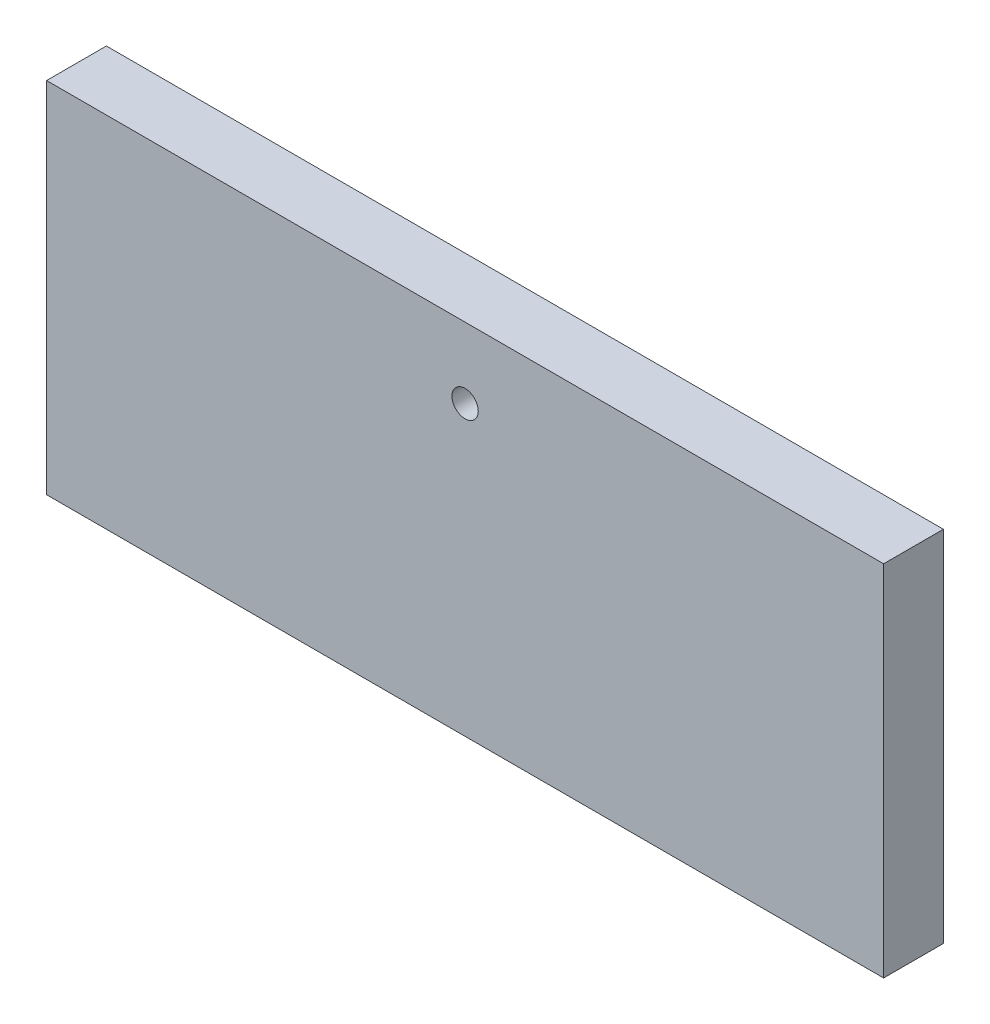
ISO-10303-21;
HEADER;
FILE_DESCRIPTION(('STEP AP214'),'2;1');
FILE_NAME('part.step','',(''),(''),'','','');
FILE_SCHEMA(('AUTOMOTIVE_DESIGN { 1 0 10303 214 1 1 1 1 }'));
ENDSEC;
DATA;
#1=APPLICATION_CONTEXT('core data for automotive mechanical design processes');
#2=APPLICATION_PROTOCOL_DEFINITION('international standard','automotive_design',2000,#1);
#3=PRODUCT_CONTEXT('',#1,'mechanical');
#4=PRODUCT('Part','Part','',(#3));
#5=PRODUCT_RELATED_PRODUCT_CATEGORY('part','',(#4));
#6=PRODUCT_DEFINITION_FORMATION('','',#4);
#7=PRODUCT_DEFINITION_CONTEXT('part definition',#1,'design');
#8=PRODUCT_DEFINITION('design','',#6,#7);
#9=PRODUCT_DEFINITION_SHAPE('','',#8);
#10=(LENGTH_UNIT() NAMED_UNIT(*) SI_UNIT(.MILLI.,.METRE.));
#11=(NAMED_UNIT(*) PLANE_ANGLE_UNIT() SI_UNIT($,.RADIAN.));
#12=(NAMED_UNIT(*) SI_UNIT($,.STERADIAN.) SOLID_ANGLE_UNIT());
#13=UNCERTAINTY_MEASURE_WITH_UNIT(LENGTH_MEASURE(1.E-05),#10,'distance_accuracy_value','');
#14=(GEOMETRIC_REPRESENTATION_CONTEXT(3) GLOBAL_UNCERTAINTY_ASSIGNED_CONTEXT((#13)) GLOBAL_UNIT_ASSIGNED_CONTEXT((#10,
#11,#12)) REPRESENTATION_CONTEXT('',''));
#15=CARTESIAN_POINT('',(0.,0.,0.));
#16=DIRECTION('',(0.,0.,1.));
#17=DIRECTION('',(1.,0.,0.));
#18=AXIS2_PLACEMENT_3D('',#15,#16,#17);
#19=CARTESIAN_POINT('',(0.,0.,25.));
#20=DIRECTION('',(0.,0.,-1.));
#21=DIRECTION('',(-1.,0.,0.));
#22=AXIS2_PLACEMENT_3D('',#19,#20,#21);
#23=PLANE('',#22);
#24=DIRECTION('',(0.,-1.,0.));
#25=VECTOR('',#24,1.);
#26=CARTESIAN_POINT('',(-350.,0.,25.));
#27=LINE('',#26,#25);
#28=CARTESIAN_POINT('',(-350.,300.,25.));
#29=VERTEX_POINT('',#28);
#30=CARTESIAN_POINT('',(-350.,0.,25.));
#31=VERTEX_POINT('',#30);
#32=EDGE_CURVE('E87',#29,#31,#27,.T.);
#33=ORIENTED_EDGE('',*,*,#32,.T.);
#34=DIRECTION('',(1.,0.,0.));
#35=VECTOR('',#34,1.);
#36=CARTESIAN_POINT('',(-350.,0.,25.));
#37=LINE('',#36,#35);
#38=CARTESIAN_POINT('',(350.,0.,25.));
#39=VERTEX_POINT('',#38);
#40=EDGE_CURVE('E82',#31,#39,#37,.T.);
#41=ORIENTED_EDGE('',*,*,#40,.T.);
#42=DIRECTION('',(0.,1.,0.));
#43=VECTOR('',#42,1.);
#44=CARTESIAN_POINT('',(350.,0.,25.));
#45=LINE('',#44,#43);
#46=CARTESIAN_POINT('',(350.,300.,25.));
#47=VERTEX_POINT('',#46);
#48=EDGE_CURVE('E85',#39,#47,#45,.T.);
#49=ORIENTED_EDGE('',*,*,#48,.T.);
#50=DIRECTION('',(-1.,0.,0.));
#51=VECTOR('',#50,1.);
#52=CARTESIAN_POINT('',(-350.,300.,25.));
#53=LINE('',#52,#51);
#54=EDGE_CURVE('E52',#47,#29,#53,.T.);
#55=ORIENTED_EDGE('',*,*,#54,.T.);
#56=EDGE_LOOP('',(#33,#41,#49,#55));
#57=FACE_BOUND('',#56,.T.);
#58=CARTESIAN_POINT('',(0.,241.,25.));
#59=DIRECTION('',(0.,0.,1.));
#60=DIRECTION('',(1.,0.,0.));
#61=AXIS2_PLACEMENT_3D('',#58,#59,#60);
#62=CIRCLE('',#61,11.);
#63=CARTESIAN_POINT('',(11.,241.,25.));
#64=VERTEX_POINT('',#63);
#65=EDGE_CURVE('E102',#64,#64,#62,.T.);
#66=ORIENTED_EDGE('',*,*,#65,.F.);
#67=EDGE_LOOP('',(#66));
#68=FACE_BOUND('',#67,.T.);
#69=ADVANCED_FACE('F35',(#57,#68),#23,.F.);
#70=CARTESIAN_POINT('',(0.,0.,-25.));
#71=DIRECTION('',(0.,0.,-1.));
#72=DIRECTION('',(-1.,0.,0.));
#73=AXIS2_PLACEMENT_3D('',#70,#71,#72);
#74=PLANE('',#73);
#75=DIRECTION('',(0.,-1.,0.));
#76=VECTOR('',#75,1.);
#77=CARTESIAN_POINT('',(-350.,0.,-25.));
#78=LINE('',#77,#76);
#79=CARTESIAN_POINT('',(-350.,300.,-25.));
#80=VERTEX_POINT('',#79);
#81=CARTESIAN_POINT('',(-350.,0.,-25.));
#82=VERTEX_POINT('',#81);
#83=EDGE_CURVE('E99',#80,#82,#78,.T.);
#84=ORIENTED_EDGE('',*,*,#83,.F.);
#85=DIRECTION('',(-1.,0.,0.));
#86=VECTOR('',#85,1.);
#87=CARTESIAN_POINT('',(-350.,300.,-25.));
#88=LINE('',#87,#86);
#89=CARTESIAN_POINT('',(350.,300.,-25.));
#90=VERTEX_POINT('',#89);
#91=EDGE_CURVE('E75',#90,#80,#88,.T.);
#92=ORIENTED_EDGE('',*,*,#91,.F.);
#93=DIRECTION('',(0.,1.,0.));
#94=VECTOR('',#93,1.);
#95=CARTESIAN_POINT('',(350.,0.,-25.));
#96=LINE('',#95,#94);
#97=CARTESIAN_POINT('',(350.,0.,-25.));
#98=VERTEX_POINT('',#97);
#99=EDGE_CURVE('E69',#98,#90,#96,.T.);
#100=ORIENTED_EDGE('',*,*,#99,.F.);
#101=DIRECTION('',(1.,0.,0.));
#102=VECTOR('',#101,1.);
#103=CARTESIAN_POINT('',(-350.,0.,-25.));
#104=LINE('',#103,#102);
#105=EDGE_CURVE('E91',#82,#98,#104,.T.);
#106=ORIENTED_EDGE('',*,*,#105,.F.);
#107=EDGE_LOOP('',(#84,#92,#100,#106));
#108=FACE_BOUND('',#107,.T.);
#109=CARTESIAN_POINT('',(0.,241.,-25.));
#110=DIRECTION('',(0.,0.,1.));
#111=DIRECTION('',(1.,0.,0.));
#112=AXIS2_PLACEMENT_3D('',#109,#110,#111);
#113=CIRCLE('',#112,11.);
#114=CARTESIAN_POINT('',(11.,241.,-25.));
#115=VERTEX_POINT('',#114);
#116=EDGE_CURVE('E117',#115,#115,#113,.T.);
#117=ORIENTED_EDGE('',*,*,#116,.T.);
#118=EDGE_LOOP('',(#117));
#119=FACE_BOUND('',#118,.T.);
#120=ADVANCED_FACE('F110',(#108,#119),#74,.T.);
#121=CARTESIAN_POINT('',(-350.,0.,25.));
#122=DIRECTION('',(1.,0.,0.));
#123=DIRECTION('',(0.,0.,-1.));
#124=AXIS2_PLACEMENT_3D('',#121,#122,#123);
#125=PLANE('',#124);
#126=ORIENTED_EDGE('',*,*,#83,.T.);
#127=DIRECTION('',(0.,0.,-1.));
#128=VECTOR('',#127,1.);
#129=CARTESIAN_POINT('',(-350.,0.,25.));
#130=LINE('',#129,#128);
#131=EDGE_CURVE('E11',#31,#82,#130,.T.);
#132=ORIENTED_EDGE('',*,*,#131,.F.);
#133=ORIENTED_EDGE('',*,*,#32,.F.);
#134=DIRECTION('',(0.,0.,-1.));
#135=VECTOR('',#134,1.);
#136=CARTESIAN_POINT('',(-350.,300.,25.));
#137=LINE('',#136,#135);
#138=EDGE_CURVE('E95',#29,#80,#137,.T.);
#139=ORIENTED_EDGE('',*,*,#138,.T.);
#140=EDGE_LOOP('',(#126,#132,#133,#139));
#141=FACE_BOUND('',#140,.T.);
#142=ADVANCED_FACE('F37',(#141),#125,.F.);
#143=CARTESIAN_POINT('',(-350.,0.,25.));
#144=DIRECTION('',(0.,1.,0.));
#145=DIRECTION('',(0.,0.,1.));
#146=AXIS2_PLACEMENT_3D('',#143,#144,#145);
#147=PLANE('',#146);
#148=ORIENTED_EDGE('',*,*,#105,.T.);
#149=DIRECTION('',(0.,0.,-1.));
#150=VECTOR('',#149,1.);
#151=CARTESIAN_POINT('',(350.,0.,25.));
#152=LINE('',#151,#150);
#153=EDGE_CURVE('E44',#39,#98,#152,.T.);
#154=ORIENTED_EDGE('',*,*,#153,.F.);
#155=ORIENTED_EDGE('',*,*,#40,.F.);
#156=ORIENTED_EDGE('',*,*,#131,.T.);
#157=EDGE_LOOP('',(#148,#154,#155,#156));
#158=FACE_BOUND('',#157,.T.);
#159=ADVANCED_FACE('F90',(#158),#147,.F.);
#160=CARTESIAN_POINT('',(350.,0.,25.));
#161=DIRECTION('',(-1.,0.,0.));
#162=DIRECTION('',(0.,0.,1.));
#163=AXIS2_PLACEMENT_3D('',#160,#161,#162);
#164=PLANE('',#163);
#165=ORIENTED_EDGE('',*,*,#99,.T.);
#166=DIRECTION('',(0.,0.,-1.));
#167=VECTOR('',#166,1.);
#168=CARTESIAN_POINT('',(350.,300.,25.));
#169=LINE('',#168,#167);
#170=EDGE_CURVE('E92',#47,#90,#169,.T.);
#171=ORIENTED_EDGE('',*,*,#170,.F.);
#172=ORIENTED_EDGE('',*,*,#48,.F.);
#173=ORIENTED_EDGE('',*,*,#153,.T.);
#174=EDGE_LOOP('',(#165,#171,#172,#173));
#175=FACE_BOUND('',#174,.T.);
#176=ADVANCED_FACE('F93',(#175),#164,.F.);
#177=CARTESIAN_POINT('',(-350.,300.,25.));
#178=DIRECTION('',(0.,-1.,0.));
#179=DIRECTION('',(0.,0.,-1.));
#180=AXIS2_PLACEMENT_3D('',#177,#178,#179);
#181=PLANE('',#180);
#182=ORIENTED_EDGE('',*,*,#91,.T.);
#183=ORIENTED_EDGE('',*,*,#138,.F.);
#184=ORIENTED_EDGE('',*,*,#54,.F.);
#185=ORIENTED_EDGE('',*,*,#170,.T.);
#186=EDGE_LOOP('',(#182,#183,#184,#185));
#187=FACE_BOUND('',#186,.T.);
#188=ADVANCED_FACE('F107',(#187),#181,.F.);
#189=CARTESIAN_POINT('',(0.,241.,25.));
#190=DIRECTION('',(0.,0.,-1.));
#191=DIRECTION('',(-1.,0.,0.));
#192=AXIS2_PLACEMENT_3D('',#189,#190,#191);
#193=CYLINDRICAL_SURFACE('',#192,11.);
#194=ORIENTED_EDGE('',*,*,#65,.T.);
#195=EDGE_LOOP('',(#194));
#196=FACE_BOUND('',#195,.T.);
#197=ORIENTED_EDGE('',*,*,#116,.F.);
#198=EDGE_LOOP('',(#197));
#199=FACE_BOUND('',#198,.T.);
#200=ADVANCED_FACE('F122',(#196,#199),#193,.F.);
#201=CLOSED_SHELL('',(#69,#120,#142,#159,#176,#188,#200));
#202=MANIFOLD_SOLID_BREP('B2',#201);
#203=ADVANCED_BREP_SHAPE_REPRESENTATION('',(#18,#202),#14);
#204=SHAPE_DEFINITION_REPRESENTATION(#9,#203);
ENDSEC;
END-ISO-10303-21;
